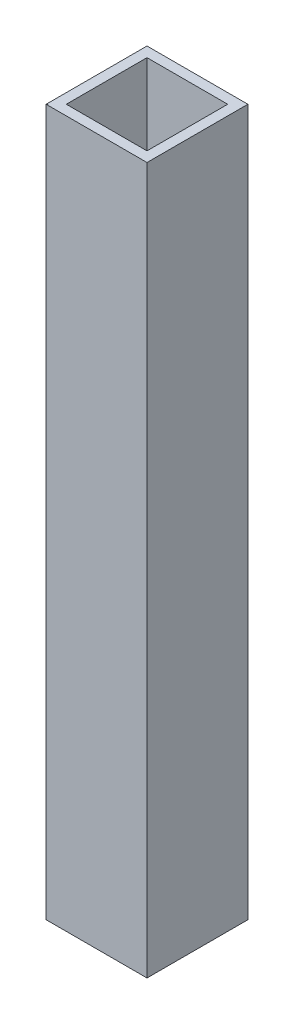
ISO-10303-21;
HEADER;
FILE_DESCRIPTION(('STEP AP214'),'2;1');
FILE_NAME('part.step','',(''),(''),'','','');
FILE_SCHEMA(('AUTOMOTIVE_DESIGN { 1 0 10303 214 1 1 1 1 }'));
ENDSEC;
DATA;
#1=APPLICATION_CONTEXT('core data for automotive mechanical design processes');
#2=APPLICATION_PROTOCOL_DEFINITION('international standard','automotive_design',2000,#1);
#3=PRODUCT_CONTEXT('',#1,'mechanical');
#4=PRODUCT('Part','Part','',(#3));
#5=PRODUCT_RELATED_PRODUCT_CATEGORY('part','',(#4));
#6=PRODUCT_DEFINITION_FORMATION('','',#4);
#7=PRODUCT_DEFINITION_CONTEXT('part definition',#1,'design');
#8=PRODUCT_DEFINITION('design','',#6,#7);
#9=PRODUCT_DEFINITION_SHAPE('','',#8);
#10=(LENGTH_UNIT() NAMED_UNIT(*) SI_UNIT(.MILLI.,.METRE.));
#11=(NAMED_UNIT(*) PLANE_ANGLE_UNIT() SI_UNIT($,.RADIAN.));
#12=(NAMED_UNIT(*) SI_UNIT($,.STERADIAN.) SOLID_ANGLE_UNIT());
#13=UNCERTAINTY_MEASURE_WITH_UNIT(LENGTH_MEASURE(1.E-05),#10,'distance_accuracy_value','');
#14=(GEOMETRIC_REPRESENTATION_CONTEXT(3) GLOBAL_UNCERTAINTY_ASSIGNED_CONTEXT((#13)) GLOBAL_UNIT_ASSIGNED_CONTEXT((#10,
#11,#12)) REPRESENTATION_CONTEXT('',''));
#15=CARTESIAN_POINT('',(0.,0.,0.));
#16=DIRECTION('',(0.,0.,1.));
#17=DIRECTION('',(1.,0.,0.));
#18=AXIS2_PLACEMENT_3D('',#15,#16,#17);
#19=CARTESIAN_POINT('',(-5.,0.,-5.));
#20=DIRECTION('',(0.,0.,-1.));
#21=DIRECTION('',(-1.,0.,0.));
#22=AXIS2_PLACEMENT_3D('',#19,#20,#21);
#23=PLANE('',#22);
#24=DIRECTION('',(1.,0.,0.));
#25=VECTOR('',#24,1.);
#26=CARTESIAN_POINT('',(-5.,-70.,-5.));
#27=LINE('',#26,#25);
#28=CARTESIAN_POINT('',(-5.,-70.,-5.));
#29=VERTEX_POINT('',#28);
#30=CARTESIAN_POINT('',(5.,-70.,-5.));
#31=VERTEX_POINT('',#30);
#32=EDGE_CURVE('E131',#29,#31,#27,.T.);
#33=ORIENTED_EDGE('',*,*,#32,.F.);
#34=DIRECTION('',(0.,-1.,0.));
#35=VECTOR('',#34,1.);
#36=CARTESIAN_POINT('',(-5.,0.,-5.));
#37=LINE('',#36,#35);
#38=CARTESIAN_POINT('',(-5.,0.,-5.));
#39=VERTEX_POINT('',#38);
#40=EDGE_CURVE('E11',#39,#29,#37,.T.);
#41=ORIENTED_EDGE('',*,*,#40,.F.);
#42=DIRECTION('',(1.,0.,0.));
#43=VECTOR('',#42,1.);
#44=CARTESIAN_POINT('',(-5.,0.,-5.));
#45=LINE('',#44,#43);
#46=CARTESIAN_POINT('',(5.,0.,-5.));
#47=VERTEX_POINT('',#46);
#48=EDGE_CURVE('E135',#39,#47,#45,.T.);
#49=ORIENTED_EDGE('',*,*,#48,.T.);
#50=DIRECTION('',(0.,-1.,0.));
#51=VECTOR('',#50,1.);
#52=CARTESIAN_POINT('',(5.,0.,-5.));
#53=LINE('',#52,#51);
#54=EDGE_CURVE('E36',#47,#31,#53,.T.);
#55=ORIENTED_EDGE('',*,*,#54,.T.);
#56=EDGE_LOOP('',(#33,#41,#49,#55));
#57=FACE_BOUND('',#56,.T.);
#58=ADVANCED_FACE('F33',(#57),#23,.T.);
#59=CARTESIAN_POINT('',(-5.,0.,5.));
#60=DIRECTION('',(-1.,0.,0.));
#61=DIRECTION('',(0.,0.,1.));
#62=AXIS2_PLACEMENT_3D('',#59,#60,#61);
#63=PLANE('',#62);
#64=DIRECTION('',(0.,0.,-1.));
#65=VECTOR('',#64,1.);
#66=CARTESIAN_POINT('',(-5.,-70.,5.));
#67=LINE('',#66,#65);
#68=CARTESIAN_POINT('',(-5.,-70.,5.));
#69=VERTEX_POINT('',#68);
#70=EDGE_CURVE('E139',#69,#29,#67,.T.);
#71=ORIENTED_EDGE('',*,*,#70,.F.);
#72=DIRECTION('',(0.,-1.,0.));
#73=VECTOR('',#72,1.);
#74=CARTESIAN_POINT('',(-5.,0.,5.));
#75=LINE('',#74,#73);
#76=CARTESIAN_POINT('',(-5.,0.,5.));
#77=VERTEX_POINT('',#76);
#78=EDGE_CURVE('E41',#77,#69,#75,.T.);
#79=ORIENTED_EDGE('',*,*,#78,.F.);
#80=DIRECTION('',(0.,0.,-1.));
#81=VECTOR('',#80,1.);
#82=CARTESIAN_POINT('',(-5.,0.,5.));
#83=LINE('',#82,#81);
#84=EDGE_CURVE('E145',#77,#39,#83,.T.);
#85=ORIENTED_EDGE('',*,*,#84,.T.);
#86=ORIENTED_EDGE('',*,*,#40,.T.);
#87=EDGE_LOOP('',(#71,#79,#85,#86));
#88=FACE_BOUND('',#87,.T.);
#89=ADVANCED_FACE('F171',(#88),#63,.T.);
#90=CARTESIAN_POINT('',(5.,0.,5.));
#91=DIRECTION('',(0.,0.,1.));
#92=DIRECTION('',(1.,0.,0.));
#93=AXIS2_PLACEMENT_3D('',#90,#91,#92);
#94=PLANE('',#93);
#95=DIRECTION('',(-1.,0.,0.));
#96=VECTOR('',#95,1.);
#97=CARTESIAN_POINT('',(5.,-70.,5.));
#98=LINE('',#97,#96);
#99=CARTESIAN_POINT('',(5.,-70.,5.));
#100=VERTEX_POINT('',#99);
#101=EDGE_CURVE('E153',#100,#69,#98,.T.);
#102=ORIENTED_EDGE('',*,*,#101,.F.);
#103=DIRECTION('',(0.,-1.,0.));
#104=VECTOR('',#103,1.);
#105=CARTESIAN_POINT('',(5.,0.,5.));
#106=LINE('',#105,#104);
#107=CARTESIAN_POINT('',(5.,0.,5.));
#108=VERTEX_POINT('',#107);
#109=EDGE_CURVE('E158',#108,#100,#106,.T.);
#110=ORIENTED_EDGE('',*,*,#109,.F.);
#111=DIRECTION('',(-1.,0.,0.));
#112=VECTOR('',#111,1.);
#113=CARTESIAN_POINT('',(5.,0.,5.));
#114=LINE('',#113,#112);
#115=EDGE_CURVE('E142',#108,#77,#114,.T.);
#116=ORIENTED_EDGE('',*,*,#115,.T.);
#117=ORIENTED_EDGE('',*,*,#78,.T.);
#118=EDGE_LOOP('',(#102,#110,#116,#117));
#119=FACE_BOUND('',#118,.T.);
#120=ADVANCED_FACE('F175',(#119),#94,.T.);
#121=CARTESIAN_POINT('',(5.,0.,-5.));
#122=DIRECTION('',(1.,0.,0.));
#123=DIRECTION('',(0.,0.,-1.));
#124=AXIS2_PLACEMENT_3D('',#121,#122,#123);
#125=PLANE('',#124);
#126=DIRECTION('',(0.,0.,1.));
#127=VECTOR('',#126,1.);
#128=CARTESIAN_POINT('',(5.,-70.,-5.));
#129=LINE('',#128,#127);
#130=EDGE_CURVE('E150',#31,#100,#129,.T.);
#131=ORIENTED_EDGE('',*,*,#130,.F.);
#132=ORIENTED_EDGE('',*,*,#54,.F.);
#133=DIRECTION('',(0.,0.,1.));
#134=VECTOR('',#133,1.);
#135=CARTESIAN_POINT('',(5.,0.,-5.));
#136=LINE('',#135,#134);
#137=EDGE_CURVE('E138',#47,#108,#136,.T.);
#138=ORIENTED_EDGE('',*,*,#137,.T.);
#139=ORIENTED_EDGE('',*,*,#109,.T.);
#140=EDGE_LOOP('',(#131,#132,#138,#139));
#141=FACE_BOUND('',#140,.T.);
#142=ADVANCED_FACE('F166',(#141),#125,.T.);
#143=CARTESIAN_POINT('',(0.,0.,0.));
#144=DIRECTION('',(0.,-1.,0.));
#145=DIRECTION('',(0.,0.,-1.));
#146=AXIS2_PLACEMENT_3D('',#143,#144,#145);
#147=PLANE('',#146);
#148=DIRECTION('',(-1.,0.,0.));
#149=VECTOR('',#148,1.);
#150=CARTESIAN_POINT('',(-4.,0.,4.));
#151=LINE('',#150,#149);
#152=CARTESIAN_POINT('',(4.,0.,4.));
#153=VERTEX_POINT('',#152);
#154=CARTESIAN_POINT('',(-4.,0.,4.));
#155=VERTEX_POINT('',#154);
#156=EDGE_CURVE('E106',#153,#155,#151,.T.);
#157=ORIENTED_EDGE('',*,*,#156,.T.);
#158=DIRECTION('',(0.,0.,-1.));
#159=VECTOR('',#158,1.);
#160=CARTESIAN_POINT('',(-4.,0.,-4.));
#161=LINE('',#160,#159);
#162=CARTESIAN_POINT('',(-4.,0.,-4.));
#163=VERTEX_POINT('',#162);
#164=EDGE_CURVE('E100',#155,#163,#161,.T.);
#165=ORIENTED_EDGE('',*,*,#164,.T.);
#166=DIRECTION('',(1.,0.,0.));
#167=VECTOR('',#166,1.);
#168=CARTESIAN_POINT('',(4.,0.,-4.));
#169=LINE('',#168,#167);
#170=CARTESIAN_POINT('',(4.,0.,-4.));
#171=VERTEX_POINT('',#170);
#172=EDGE_CURVE('E109',#163,#171,#169,.T.);
#173=ORIENTED_EDGE('',*,*,#172,.T.);
#174=DIRECTION('',(0.,0.,1.));
#175=VECTOR('',#174,1.);
#176=CARTESIAN_POINT('',(4.,0.,4.));
#177=LINE('',#176,#175);
#178=EDGE_CURVE('E49',#171,#153,#177,.T.);
#179=ORIENTED_EDGE('',*,*,#178,.T.);
#180=EDGE_LOOP('',(#157,#165,#173,#179));
#181=FACE_BOUND('',#180,.T.);
#182=ORIENTED_EDGE('',*,*,#48,.F.);
#183=ORIENTED_EDGE('',*,*,#84,.F.);
#184=ORIENTED_EDGE('',*,*,#115,.F.);
#185=ORIENTED_EDGE('',*,*,#137,.F.);
#186=EDGE_LOOP('',(#182,#183,#184,#185));
#187=FACE_BOUND('',#186,.T.);
#188=ADVANCED_FACE('F113',(#181,#187),#147,.F.);
#189=CARTESIAN_POINT('',(0.,-70.,0.));
#190=DIRECTION('',(0.,-1.,0.));
#191=DIRECTION('',(0.,0.,-1.));
#192=AXIS2_PLACEMENT_3D('',#189,#190,#191);
#193=PLANE('',#192);
#194=DIRECTION('',(0.,0.,-1.));
#195=VECTOR('',#194,1.);
#196=CARTESIAN_POINT('',(-4.,-70.,-4.));
#197=LINE('',#196,#195);
#198=CARTESIAN_POINT('',(-4.,-70.,4.));
#199=VERTEX_POINT('',#198);
#200=CARTESIAN_POINT('',(-4.,-70.,-4.));
#201=VERTEX_POINT('',#200);
#202=EDGE_CURVE('E57',#199,#201,#197,.T.);
#203=ORIENTED_EDGE('',*,*,#202,.F.);
#204=DIRECTION('',(-1.,0.,0.));
#205=VECTOR('',#204,1.);
#206=CARTESIAN_POINT('',(-4.,-70.,4.));
#207=LINE('',#206,#205);
#208=CARTESIAN_POINT('',(4.,-70.,4.));
#209=VERTEX_POINT('',#208);
#210=EDGE_CURVE('E116',#209,#199,#207,.T.);
#211=ORIENTED_EDGE('',*,*,#210,.F.);
#212=DIRECTION('',(0.,0.,1.));
#213=VECTOR('',#212,1.);
#214=CARTESIAN_POINT('',(4.,-70.,4.));
#215=LINE('',#214,#213);
#216=CARTESIAN_POINT('',(4.,-70.,-4.));
#217=VERTEX_POINT('',#216);
#218=EDGE_CURVE('E119',#217,#209,#215,.T.);
#219=ORIENTED_EDGE('',*,*,#218,.F.);
#220=DIRECTION('',(1.,0.,0.));
#221=VECTOR('',#220,1.);
#222=CARTESIAN_POINT('',(4.,-70.,-4.));
#223=LINE('',#222,#221);
#224=EDGE_CURVE('E125',#201,#217,#223,.T.);
#225=ORIENTED_EDGE('',*,*,#224,.F.);
#226=EDGE_LOOP('',(#203,#211,#219,#225));
#227=FACE_BOUND('',#226,.T.);
#228=ORIENTED_EDGE('',*,*,#32,.T.);
#229=ORIENTED_EDGE('',*,*,#130,.T.);
#230=ORIENTED_EDGE('',*,*,#101,.T.);
#231=ORIENTED_EDGE('',*,*,#70,.T.);
#232=EDGE_LOOP('',(#228,#229,#230,#231));
#233=FACE_BOUND('',#232,.T.);
#234=ADVANCED_FACE('F168',(#227,#233),#193,.T.);
#235=CARTESIAN_POINT('',(-4.,0.,-4.));
#236=DIRECTION('',(-1.,0.,0.));
#237=DIRECTION('',(0.,0.,1.));
#238=AXIS2_PLACEMENT_3D('',#235,#236,#237);
#239=PLANE('',#238);
#240=ORIENTED_EDGE('',*,*,#202,.T.);
#241=DIRECTION('',(0.,-1.,0.));
#242=VECTOR('',#241,1.);
#243=CARTESIAN_POINT('',(-4.,0.,-4.));
#244=LINE('',#243,#242);
#245=EDGE_CURVE('E96',#163,#201,#244,.T.);
#246=ORIENTED_EDGE('',*,*,#245,.F.);
#247=ORIENTED_EDGE('',*,*,#164,.F.);
#248=DIRECTION('',(0.,-1.,0.));
#249=VECTOR('',#248,1.);
#250=CARTESIAN_POINT('',(-4.,0.,4.));
#251=LINE('',#250,#249);
#252=EDGE_CURVE('E129',#155,#199,#251,.T.);
#253=ORIENTED_EDGE('',*,*,#252,.T.);
#254=EDGE_LOOP('',(#240,#246,#247,#253));
#255=FACE_BOUND('',#254,.T.);
#256=ADVANCED_FACE('F98',(#255),#239,.F.);
#257=CARTESIAN_POINT('',(-4.,0.,4.));
#258=DIRECTION('',(0.,0.,1.));
#259=DIRECTION('',(1.,0.,0.));
#260=AXIS2_PLACEMENT_3D('',#257,#258,#259);
#261=PLANE('',#260);
#262=ORIENTED_EDGE('',*,*,#210,.T.);
#263=ORIENTED_EDGE('',*,*,#252,.F.);
#264=ORIENTED_EDGE('',*,*,#156,.F.);
#265=DIRECTION('',(0.,-1.,0.));
#266=VECTOR('',#265,1.);
#267=CARTESIAN_POINT('',(4.,0.,4.));
#268=LINE('',#267,#266);
#269=EDGE_CURVE('E132',#153,#209,#268,.T.);
#270=ORIENTED_EDGE('',*,*,#269,.T.);
#271=EDGE_LOOP('',(#262,#263,#264,#270));
#272=FACE_BOUND('',#271,.T.);
#273=ADVANCED_FACE('F226',(#272),#261,.F.);
#274=CARTESIAN_POINT('',(4.,0.,4.));
#275=DIRECTION('',(1.,0.,0.));
#276=DIRECTION('',(0.,0.,-1.));
#277=AXIS2_PLACEMENT_3D('',#274,#275,#276);
#278=PLANE('',#277);
#279=ORIENTED_EDGE('',*,*,#218,.T.);
#280=ORIENTED_EDGE('',*,*,#269,.F.);
#281=ORIENTED_EDGE('',*,*,#178,.F.);
#282=DIRECTION('',(0.,-1.,0.));
#283=VECTOR('',#282,1.);
#284=CARTESIAN_POINT('',(4.,0.,-4.));
#285=LINE('',#284,#283);
#286=EDGE_CURVE('E105',#171,#217,#285,.T.);
#287=ORIENTED_EDGE('',*,*,#286,.T.);
#288=EDGE_LOOP('',(#279,#280,#281,#287));
#289=FACE_BOUND('',#288,.T.);
#290=ADVANCED_FACE('F235',(#289),#278,.F.);
#291=CARTESIAN_POINT('',(4.,0.,-4.));
#292=DIRECTION('',(0.,0.,-1.));
#293=DIRECTION('',(-1.,0.,0.));
#294=AXIS2_PLACEMENT_3D('',#291,#292,#293);
#295=PLANE('',#294);
#296=ORIENTED_EDGE('',*,*,#224,.T.);
#297=ORIENTED_EDGE('',*,*,#286,.F.);
#298=ORIENTED_EDGE('',*,*,#172,.F.);
#299=ORIENTED_EDGE('',*,*,#245,.T.);
#300=EDGE_LOOP('',(#296,#297,#298,#299));
#301=FACE_BOUND('',#300,.T.);
#302=ADVANCED_FACE('F110',(#301),#295,.F.);
#303=CLOSED_SHELL('',(#58,#89,#120,#142,#188,#234,#256,#273,#290,#302));
#304=MANIFOLD_SOLID_BREP('B2',#303);
#305=ADVANCED_BREP_SHAPE_REPRESENTATION('',(#18,#304),#14);
#306=SHAPE_DEFINITION_REPRESENTATION(#9,#305);
ENDSEC;
END-ISO-10303-21;
